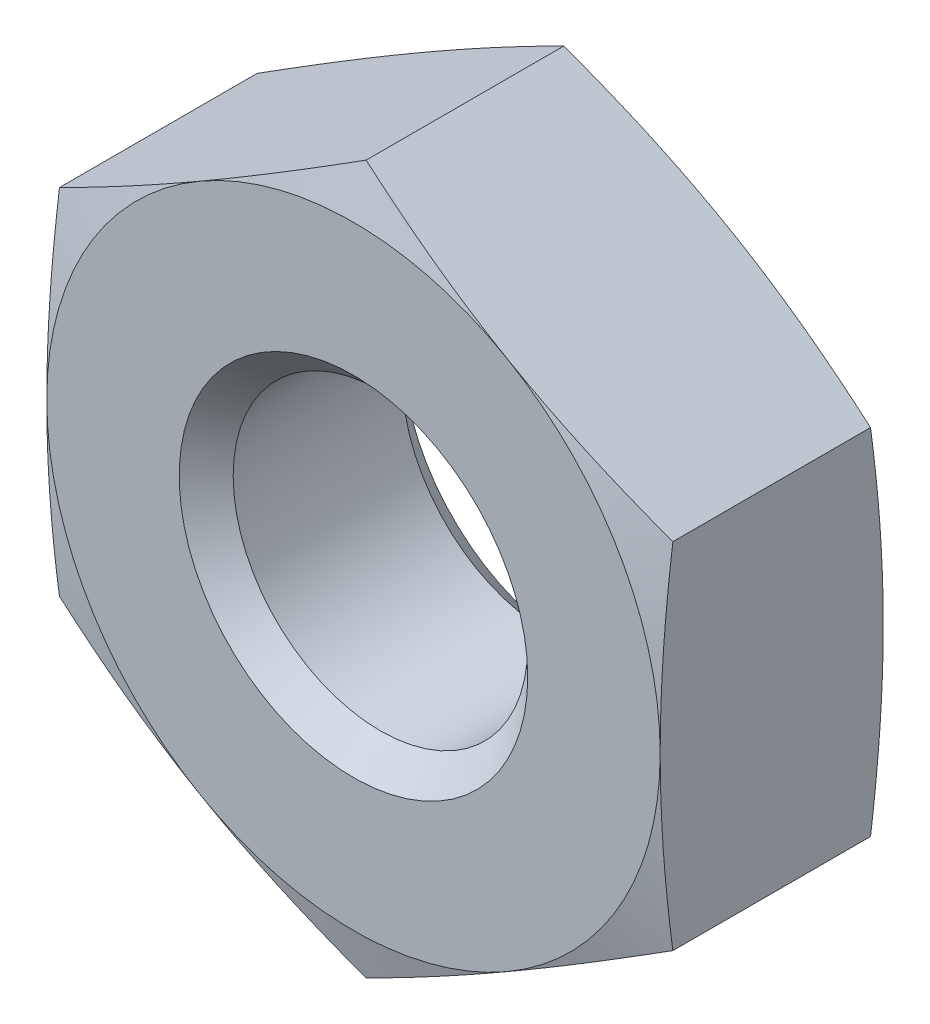
ISO-10303-21;
HEADER;
FILE_DESCRIPTION(('STEP AP214'),'2;1');
FILE_NAME('part.step','',(''),(''),'','','');
FILE_SCHEMA(('AUTOMOTIVE_DESIGN { 1 0 10303 214 1 1 1 1 }'));
ENDSEC;
DATA;
#1=APPLICATION_CONTEXT('core data for automotive mechanical design processes');
#2=APPLICATION_PROTOCOL_DEFINITION('international standard','automotive_design',2000,#1);
#3=PRODUCT_CONTEXT('',#1,'mechanical');
#4=PRODUCT('Part','Part','',(#3));
#5=PRODUCT_RELATED_PRODUCT_CATEGORY('part','',(#4));
#6=PRODUCT_DEFINITION_FORMATION('','',#4);
#7=PRODUCT_DEFINITION_CONTEXT('part definition',#1,'design');
#8=PRODUCT_DEFINITION('design','',#6,#7);
#9=PRODUCT_DEFINITION_SHAPE('','',#8);
#10=(LENGTH_UNIT() NAMED_UNIT(*) SI_UNIT(.MILLI.,.METRE.));
#11=(NAMED_UNIT(*) PLANE_ANGLE_UNIT() SI_UNIT($,.RADIAN.));
#12=(NAMED_UNIT(*) SI_UNIT($,.STERADIAN.) SOLID_ANGLE_UNIT());
#13=UNCERTAINTY_MEASURE_WITH_UNIT(LENGTH_MEASURE(1.E-05),#10,'distance_accuracy_value','');
#14=(GEOMETRIC_REPRESENTATION_CONTEXT(3) GLOBAL_UNCERTAINTY_ASSIGNED_CONTEXT((#13)) GLOBAL_UNIT_ASSIGNED_CONTEXT((#10,
#11,#12)) REPRESENTATION_CONTEXT('',''));
#15=CARTESIAN_POINT('',(0.,0.,0.));
#16=DIRECTION('',(0.,0.,1.));
#17=DIRECTION('',(1.,0.,0.));
#18=AXIS2_PLACEMENT_3D('',#15,#16,#17);
#19=CARTESIAN_POINT('',(0.,0.,0.));
#20=DIRECTION('',(0.,0.,-1.));
#21=DIRECTION('',(-1.,0.,0.));
#22=AXIS2_PLACEMENT_3D('',#19,#20,#21);
#23=PLANE('',#22);
#24=CARTESIAN_POINT('',(0.,0.,0.));
#25=DIRECTION('',(0.,0.,1.));
#26=DIRECTION('',(1.,0.,0.));
#27=AXIS2_PLACEMENT_3D('',#24,#25,#26);
#28=CIRCLE('',#27,5.588);
#29=CARTESIAN_POINT('',(5.588,0.,0.));
#30=VERTEX_POINT('',#29);
#31=CARTESIAN_POINT('',(2.79400000000005,4.83934995634742,0.));
#32=VERTEX_POINT('',#31);
#33=EDGE_CURVE('E11',#30,#32,#28,.T.);
#34=ORIENTED_EDGE('',*,*,#33,.T.);
#35=CARTESIAN_POINT('',(-2.79400000000005,4.83934995634742,0.));
#36=VERTEX_POINT('',#35);
#37=EDGE_CURVE('E43',#32,#36,#28,.T.);
#38=ORIENTED_EDGE('',*,*,#37,.T.);
#39=CARTESIAN_POINT('',(-5.588,0.,0.));
#40=VERTEX_POINT('',#39);
#41=EDGE_CURVE('E328',#36,#40,#28,.T.);
#42=ORIENTED_EDGE('',*,*,#41,.T.);
#43=CARTESIAN_POINT('',(-2.79400000000005,-4.83934995634742,0.));
#44=VERTEX_POINT('',#43);
#45=EDGE_CURVE('E321',#40,#44,#28,.T.);
#46=ORIENTED_EDGE('',*,*,#45,.T.);
#47=CARTESIAN_POINT('',(2.79400000000005,-4.83934995634742,0.));
#48=VERTEX_POINT('',#47);
#49=EDGE_CURVE('E324',#44,#48,#28,.T.);
#50=ORIENTED_EDGE('',*,*,#49,.T.);
#51=EDGE_CURVE('E44',#48,#30,#28,.T.);
#52=ORIENTED_EDGE('',*,*,#51,.T.);
#53=EDGE_LOOP('',(#34,#38,#42,#46,#50,#52));
#54=FACE_BOUND('',#53,.T.);
#55=CARTESIAN_POINT('',(0.,0.,0.));
#56=DIRECTION('',(0.,0.,1.));
#57=DIRECTION('',(1.,0.,0.));
#58=AXIS2_PLACEMENT_3D('',#55,#56,#57);
#59=CIRCLE('',#58,3.175);
#60=CARTESIAN_POINT('',(3.175,0.,0.));
#61=VERTEX_POINT('',#60);
#62=EDGE_CURVE('E185',#61,#61,#59,.T.);
#63=ORIENTED_EDGE('',*,*,#62,.F.);
#64=EDGE_LOOP('',(#63));
#65=FACE_BOUND('',#64,.T.);
#66=ADVANCED_FACE('F36',(#54,#65),#23,.F.);
#67=CARTESIAN_POINT('',(0.,5.588,-4.064));
#68=DIRECTION('',(0.,0.,1.));
#69=DIRECTION('',(1.,0.,0.));
#70=AXIS2_PLACEMENT_3D('',#67,#68,#69);
#71=PLANE('',#70);
#72=CARTESIAN_POINT('',(0.,0.,-4.064));
#73=DIRECTION('',(0.,0.,1.));
#74=DIRECTION('',(1.,0.,0.));
#75=AXIS2_PLACEMENT_3D('',#72,#73,#74);
#76=CIRCLE('',#75,5.588);
#77=CARTESIAN_POINT('',(5.588,0.,-4.064));
#78=VERTEX_POINT('',#77);
#79=CARTESIAN_POINT('',(2.79400000000005,4.83934995634742,-4.064));
#80=VERTEX_POINT('',#79);
#81=EDGE_CURVE('E359',#78,#80,#76,.T.);
#82=ORIENTED_EDGE('',*,*,#81,.F.);
#83=CARTESIAN_POINT('',(2.79400000000005,-4.83934995634742,-4.064));
#84=VERTEX_POINT('',#83);
#85=EDGE_CURVE('E362',#84,#78,#76,.T.);
#86=ORIENTED_EDGE('',*,*,#85,.F.);
#87=CARTESIAN_POINT('',(-2.79400000000005,-4.83934995634742,-4.064));
#88=VERTEX_POINT('',#87);
#89=EDGE_CURVE('E363',#88,#84,#76,.T.);
#90=ORIENTED_EDGE('',*,*,#89,.F.);
#91=CARTESIAN_POINT('',(-5.588,0.,-4.064));
#92=VERTEX_POINT('',#91);
#93=EDGE_CURVE('E143',#92,#88,#76,.T.);
#94=ORIENTED_EDGE('',*,*,#93,.F.);
#95=CARTESIAN_POINT('',(-2.79400000000005,4.83934995634742,-4.064));
#96=VERTEX_POINT('',#95);
#97=EDGE_CURVE('E360',#96,#92,#76,.T.);
#98=ORIENTED_EDGE('',*,*,#97,.F.);
#99=EDGE_CURVE('E356',#80,#96,#76,.T.);
#100=ORIENTED_EDGE('',*,*,#99,.F.);
#101=EDGE_LOOP('',(#82,#86,#90,#94,#98,#100));
#102=FACE_BOUND('',#101,.T.);
#103=CARTESIAN_POINT('',(0.,0.,-4.064));
#104=DIRECTION('',(0.,0.,1.));
#105=DIRECTION('',(1.,0.,0.));
#106=AXIS2_PLACEMENT_3D('',#103,#104,#105);
#107=CIRCLE('',#106,3.175);
#108=CARTESIAN_POINT('',(3.175,0.,-4.064));
#109=VERTEX_POINT('',#108);
#110=EDGE_CURVE('E205',#109,#109,#107,.T.);
#111=ORIENTED_EDGE('',*,*,#110,.T.);
#112=EDGE_LOOP('',(#111));
#113=FACE_BOUND('',#112,.T.);
#114=ADVANCED_FACE('F209',(#102,#113),#71,.F.);
#115=CARTESIAN_POINT('',(0.,0.,-0.29946001746102));
#116=DIRECTION('',(0.,0.,-1.));
#117=DIRECTION('',(-1.,0.,0.));
#118=AXIS2_PLACEMENT_3D('',#115,#116,#117);
#119=CONICAL_SURFACE('',#118,6.7056,1.30899693899575);
#120=CARTESIAN_POINT('',(-5.5882,3.22611783417776,-0.231664070559589));
#121=CARTESIAN_POINT('',(-5.35612782990446,3.36010476405385,-0.195746870929783));
#122=CARTESIAN_POINT('',(-5.12363487986488,3.49433463134389,-0.163139951670658));
#123=CARTESIAN_POINT('',(-4.65782789403413,3.76326842000369,-0.105852616921359));
#124=CARTESIAN_POINT('',(-4.42451356350618,3.8979725115398,-0.0811754211835394));
#125=CARTESIAN_POINT('',(-3.95847843653514,4.16703801754836,-0.0411882021790151));
#126=CARTESIAN_POINT('',(-3.72576079157954,4.30139761250865,-0.0258304913572314));
#127=CARTESIAN_POINT('',(-3.26002872031104,4.57028814922577,-0.0052373695311401));
#128=CARTESIAN_POINT('',(-3.02701436015552,4.70481905278661,0.));
#129=CARTESIAN_POINT('',(-2.56098563984448,4.97388085990829,0.));
#130=CARTESIAN_POINT('',(-2.32797127968896,5.10841176346913,-0.00523736953114312));
#131=CARTESIAN_POINT('',(-1.86223920842046,5.37730230018625,-0.0258304913572373));
#132=CARTESIAN_POINT('',(-1.62952156346486,5.51166189514654,-0.0411882021790223));
#133=CARTESIAN_POINT('',(-1.16348643649382,5.7807274011551,-0.0811754211835491));
#134=CARTESIAN_POINT('',(-0.930172105965868,5.91543149269121,-0.105852616921369));
#135=CARTESIAN_POINT('',(-0.464365120135121,6.18436528135101,-0.163139951670671));
#136=CARTESIAN_POINT('',(-0.231872170095539,6.31859514864105,-0.195746870929797));
#137=CARTESIAN_POINT('',(0.00020000000000052,6.45258207851714,-0.231664070559604));
#138=B_SPLINE_CURVE_WITH_KNOTS('',3,(#120,#121,#122,#123,#124,#125,#126,#127,#128,#129,#130,
#131,#132,#133,#134,#135,#136,#137),.UNSPECIFIED.,.F.,.F.,(4,2,2,2,2,2,2,2,4),(0.,
0.811153043466145,1.62263502922855,2.42992887829337,3.23706648113787,4.04420408398236,
4.85149793304719,5.66297991880959,6.47413296227574),.UNSPECIFIED.);
#139=CARTESIAN_POINT('',(-5.588,3.2262333042316,-0.231633129621396));
#140=VERTEX_POINT('',#139);
#141=EDGE_CURVE('E336',#140,#36,#138,.T.);
#142=ORIENTED_EDGE('',*,*,#141,.F.);
#143=CARTESIAN_POINT('',(-5.588,-8.5345781558909,-1.23610698190292));
#144=CARTESIAN_POINT('',(-5.588,-8.2810666555153,-1.17929190345188));
#145=CARTESIAN_POINT('',(-5.588,-8.02739659166418,-1.12317167601285));
#146=CARTESIAN_POINT('',(-5.588,-7.51966146428766,-1.01269598670537));
#147=CARTESIAN_POINT('',(-5.588,-7.26559638419787,-0.958340601055299));
#148=CARTESIAN_POINT('',(-5.588,-6.75676576190763,-0.851722356973886));
#149=CARTESIAN_POINT('',(-5.588,-6.50199977706657,-0.799461603507953));
#150=CARTESIAN_POINT('',(-5.588,-5.99193753642248,-0.697596721983616));
#151=CARTESIAN_POINT('',(-5.588,-5.73664128511371,-0.647992571503833));
#152=CARTESIAN_POINT('',(-5.588,-5.2274623256548,-0.552455801915283));
#153=CARTESIAN_POINT('',(-5.588,-4.97358453389165,-0.506497108885283));
#154=CARTESIAN_POINT('',(-5.588,-4.46513644926147,-0.41859214361228));
#155=CARTESIAN_POINT('',(-5.588,-4.21056617175893,-0.376645783080679));
#156=CARTESIAN_POINT('',(-5.588,-3.70068369727896,-0.297709945270376));
#157=CARTESIAN_POINT('',(-5.588,-3.44537159559778,-0.260719857769151));
#158=CARTESIAN_POINT('',(-5.588,-2.93393493875483,-0.192786603359327));
#159=CARTESIAN_POINT('',(-5.588,-2.67781038283214,-0.161843442115828));
#160=CARTESIAN_POINT('',(-5.588,-2.16185925688461,-0.106880239566573));
#161=CARTESIAN_POINT('',(-5.588,-1.90202373231597,-0.0829430089921265));
#162=CARTESIAN_POINT('',(-5.588,-1.38169945268913,-0.0436429914353551));
#163=CARTESIAN_POINT('',(-5.588,-1.12121071274943,-0.0282800078110872));
#164=CARTESIAN_POINT('',(-5.588,-0.599957865229125,-0.00702451532729913));
#165=CARTESIAN_POINT('',(-5.588,-0.339193936752168,-0.0011277027289359));
#166=CARTESIAN_POINT('',(-5.588,0.1823714205785,0.00083289998433114));
#167=CARTESIAN_POINT('',(-5.588,0.443172849399691,-0.00310330142432177));
#168=CARTESIAN_POINT('',(-5.588,0.965395783501898,-0.0205873684441134));
#169=CARTESIAN_POINT('',(-5.588,1.22681609697997,-0.0341701185888975));
#170=CARTESIAN_POINT('',(-5.588,1.74904192430596,-0.0701719589647683));
#171=CARTESIAN_POINT('',(-5.588,2.00984742441393,-0.0925912448277076));
#172=CARTESIAN_POINT('',(-5.588,2.53084143141298,-0.145133688666206));
#173=CARTESIAN_POINT('',(-5.588,2.79102942338414,-0.175261874228818));
#174=CARTESIAN_POINT('',(-5.588,3.31056805499895,-0.241968464922291));
#175=CARTESIAN_POINT('',(-5.588,3.56991869201101,-0.278546890304492));
#176=CARTESIAN_POINT('',(-5.588,4.07066345789838,-0.354386980825567));
#177=CARTESIAN_POINT('',(-5.588,4.31210931806812,-0.393310528582692));
#178=CARTESIAN_POINT('',(-5.588,4.79436465416929,-0.474935820185719));
#179=CARTESIAN_POINT('',(-5.588,5.03517411255358,-0.517637667111996));
#180=CARTESIAN_POINT('',(-5.588,5.51624475472888,-0.606128311310801));
#181=CARTESIAN_POINT('',(-5.588,5.75650588738696,-0.65191738521801));
#182=CARTESIAN_POINT('',(-5.588,6.23653469126863,-0.746018904252824));
#183=CARTESIAN_POINT('',(-5.588,6.4763023560569,-0.794331382074125));
#184=CARTESIAN_POINT('',(-5.588,7.19507734129352,-0.942368376905111));
#185=CARTESIAN_POINT('',(-5.588,7.67344976698298,-1.04517234354635));
#186=CARTESIAN_POINT('',(-5.588,8.6289224376089,-1.25634555799704));
#187=CARTESIAN_POINT('',(-5.588,9.10602275524918,-1.36471448026011));
#188=CARTESIAN_POINT('',(-5.588,10.0546296591299,-1.58428870830944));
#189=CARTESIAN_POINT('',(-5.588,10.5261451434712,-1.69545567846192));
#190=CARTESIAN_POINT('',(-5.588,11.468518305583,-1.9205727346029));
#191=CARTESIAN_POINT('',(-5.588,11.9393759712045,-2.03452287129334));
#192=CARTESIAN_POINT('',(-5.588,12.8800071547142,-2.26433759268933));
#193=CARTESIAN_POINT('',(-5.588,13.3497812934371,-2.38019964138322));
#194=CARTESIAN_POINT('',(-5.588,14.2889203682476,-2.61350580925147));
#195=CARTESIAN_POINT('',(-5.588,14.7582853173276,-2.73094987608966));
#196=CARTESIAN_POINT('',(-5.588,15.2275076501709,-2.84895420254379));
#197=B_SPLINE_CURVE_WITH_KNOTS('',3,(#143,#144,#145,#146,#147,#148,#149,#150,#151,#152,#153,
#154,#155,#156,#157,#158,#159,#160,#161,#162,#163,#164,#165,#166,#167,#168,#169,#170,#171,#172,
#173,#174,#175,#176,#177,#178,#179,#180,#181,#182,#183,#184,#185,#186,#187,#188,#189,#190,#191,
#192,#193,#194,#195,#196),.UNSPECIFIED.,.F.,.F.,(4,2,2,2,2,2,2,2,2,2,2,2,2,2,2,2,2,2,2,2,2,2,2,
2,2,2,4),(0.,0.77940313721841,1.55883988993779,2.33904122995756,3.1192359841433,
3.89322268107899,4.66719234305344,5.4410666251817,6.21494163231528,6.99762519889382,
7.78029081465488,8.5626004952282,9.34490950142015,10.1300620493507,10.9152319807312,
11.7009152949557,12.4866010759757,13.2202552360327,13.9539294179764,14.6876694292733,
15.4214189494036,16.8892442231801,18.3569837277075,19.8103005500229,21.2636438677041,
22.7151937170009,24.1666956636387),.UNSPECIFIED.);
#198=EDGE_CURVE('E154',#40,#140,#197,.T.);
#199=ORIENTED_EDGE('',*,*,#198,.F.);
#200=ORIENTED_EDGE('',*,*,#41,.F.);
#201=EDGE_LOOP('',(#142,#199,#200));
#202=FACE_BOUND('',#201,.T.);
#203=ADVANCED_FACE('F227',(#202),#119,.T.);
#204=CARTESIAN_POINT('',(0.,6.4524666084633,-0.23163312962141));
#205=VERTEX_POINT('',#204);
#206=EDGE_CURVE('E333',#36,#205,#138,.T.);
#207=ORIENTED_EDGE('',*,*,#206,.F.);
#208=ORIENTED_EDGE('',*,*,#37,.F.);
#209=CARTESIAN_POINT('',(-0.0002,6.45258207851714,-0.231664070559604));
#210=CARTESIAN_POINT('',(0.231872170095539,6.31859514864105,-0.195746870929797));
#211=CARTESIAN_POINT('',(0.464365120135121,6.18436528135101,-0.163139951670671));
#212=CARTESIAN_POINT('',(0.930172105965868,5.91543149269121,-0.105852616921369));
#213=CARTESIAN_POINT('',(1.16348643649382,5.7807274011551,-0.081175421183549));
#214=CARTESIAN_POINT('',(1.62952156346486,5.51166189514654,-0.0411882021790222));
#215=CARTESIAN_POINT('',(1.86223920842046,5.37730230018625,-0.0258304913572372));
#216=CARTESIAN_POINT('',(2.32797127968896,5.10841176346913,-0.00523736953114299));
#217=CARTESIAN_POINT('',(2.56098563984448,4.97388085990829,0.));
#218=CARTESIAN_POINT('',(3.02701436015552,4.70481905278661,0.));
#219=CARTESIAN_POINT('',(3.26002872031104,4.57028814922577,-0.00523736953114009));
#220=CARTESIAN_POINT('',(3.72576079157954,4.30139761250865,-0.0258304913572314));
#221=CARTESIAN_POINT('',(3.95847843653514,4.16703801754836,-0.041188202179015));
#222=CARTESIAN_POINT('',(4.42451356350618,3.8979725115398,-0.0811754211835393));
#223=CARTESIAN_POINT('',(4.65782789403413,3.76326842000369,-0.105852616921359));
#224=CARTESIAN_POINT('',(5.12363487986488,3.49433463134389,-0.163139951670658));
#225=CARTESIAN_POINT('',(5.35612782990446,3.36010476405385,-0.195746870929783));
#226=CARTESIAN_POINT('',(5.5882,3.22611783417776,-0.231664070559589));
#227=B_SPLINE_CURVE_WITH_KNOTS('',3,(#209,#210,#211,#212,#213,#214,#215,#216,#217,#218,#219,
#220,#221,#222,#223,#224,#225,#226),.UNSPECIFIED.,.F.,.F.,(4,2,2,2,2,2,2,2,4),(0.,
0.811153043466144,1.62263502922855,2.42992887829337,3.23706648113787,4.04420408398236,
4.85149793304719,5.66297991880959,6.47413296227574),.UNSPECIFIED.);
#228=EDGE_CURVE('E266',#205,#32,#227,.T.);
#229=ORIENTED_EDGE('',*,*,#228,.F.);
#230=EDGE_LOOP('',(#207,#208,#229));
#231=FACE_BOUND('',#230,.T.);
#232=ADVANCED_FACE('F275',(#231),#119,.T.);
#233=CARTESIAN_POINT('',(5.588,3.2262333042316,-0.231633129621396));
#234=VERTEX_POINT('',#233);
#235=EDGE_CURVE('E261',#32,#234,#227,.T.);
#236=ORIENTED_EDGE('',*,*,#235,.F.);
#237=ORIENTED_EDGE('',*,*,#33,.F.);
#238=CARTESIAN_POINT('',(5.588,-8.5345781558909,-1.23610698190292));
#239=CARTESIAN_POINT('',(5.588,-8.2810666555153,-1.17929190345188));
#240=CARTESIAN_POINT('',(5.588,-8.02739659166418,-1.12317167601285));
#241=CARTESIAN_POINT('',(5.588,-7.51966146428766,-1.01269598670537));
#242=CARTESIAN_POINT('',(5.588,-7.26559638419787,-0.958340601055299));
#243=CARTESIAN_POINT('',(5.588,-6.75676576190763,-0.851722356973886));
#244=CARTESIAN_POINT('',(5.588,-6.50199977706657,-0.799461603507953));
#245=CARTESIAN_POINT('',(5.588,-5.99193753642248,-0.697596721983616));
#246=CARTESIAN_POINT('',(5.588,-5.73664128511371,-0.647992571503833));
#247=CARTESIAN_POINT('',(5.588,-5.2274623256548,-0.552455801915283));
#248=CARTESIAN_POINT('',(5.588,-4.97358453389165,-0.506497108885283));
#249=CARTESIAN_POINT('',(5.588,-4.46513644926147,-0.41859214361228));
#250=CARTESIAN_POINT('',(5.588,-4.21056617175893,-0.376645783080679));
#251=CARTESIAN_POINT('',(5.588,-3.70068369727896,-0.297709945270376));
#252=CARTESIAN_POINT('',(5.588,-3.44537159559778,-0.260719857769151));
#253=CARTESIAN_POINT('',(5.588,-2.93393493875483,-0.192786603359327));
#254=CARTESIAN_POINT('',(5.588,-2.67781038283214,-0.161843442115828));
#255=CARTESIAN_POINT('',(5.588,-2.16185925688461,-0.106880239566573));
#256=CARTESIAN_POINT('',(5.588,-1.90202373231597,-0.0829430089921265));
#257=CARTESIAN_POINT('',(5.588,-1.38169945268913,-0.0436429914353551));
#258=CARTESIAN_POINT('',(5.588,-1.12121071274943,-0.0282800078110872));
#259=CARTESIAN_POINT('',(5.588,-0.599957865229125,-0.00702451532729913));
#260=CARTESIAN_POINT('',(5.588,-0.339193936752168,-0.0011277027289359));
#261=CARTESIAN_POINT('',(5.588,0.1823714205785,0.00083289998433114));
#262=CARTESIAN_POINT('',(5.588,0.443172849399691,-0.00310330142432177));
#263=CARTESIAN_POINT('',(5.588,0.965395783501898,-0.0205873684441134));
#264=CARTESIAN_POINT('',(5.588,1.22681609697997,-0.0341701185888975));
#265=CARTESIAN_POINT('',(5.588,1.74904192430596,-0.0701719589647683));
#266=CARTESIAN_POINT('',(5.588,2.00984742441393,-0.0925912448277076));
#267=CARTESIAN_POINT('',(5.588,2.53084143141298,-0.145133688666206));
#268=CARTESIAN_POINT('',(5.588,2.79102942338414,-0.175261874228818));
#269=CARTESIAN_POINT('',(5.588,3.31056805499895,-0.241968464922291));
#270=CARTESIAN_POINT('',(5.588,3.56991869201101,-0.278546890304492));
#271=CARTESIAN_POINT('',(5.588,4.07066345789838,-0.354386980825567));
#272=CARTESIAN_POINT('',(5.588,4.31210931806812,-0.393310528582692));
#273=CARTESIAN_POINT('',(5.588,4.79436465416929,-0.474935820185719));
#274=CARTESIAN_POINT('',(5.588,5.03517411255358,-0.517637667111996));
#275=CARTESIAN_POINT('',(5.588,5.51624475472888,-0.606128311310801));
#276=CARTESIAN_POINT('',(5.588,5.75650588738696,-0.65191738521801));
#277=CARTESIAN_POINT('',(5.588,6.23653469126863,-0.746018904252824));
#278=CARTESIAN_POINT('',(5.588,6.4763023560569,-0.794331382074125));
#279=CARTESIAN_POINT('',(5.588,7.19507734129352,-0.942368376905111));
#280=CARTESIAN_POINT('',(5.588,7.67344976698298,-1.04517234354635));
#281=CARTESIAN_POINT('',(5.588,8.6289224376089,-1.25634555799704));
#282=CARTESIAN_POINT('',(5.588,9.10602275524918,-1.36471448026011));
#283=CARTESIAN_POINT('',(5.588,10.0546296591299,-1.58428870830944));
#284=CARTESIAN_POINT('',(5.588,10.5261451434712,-1.69545567846192));
#285=CARTESIAN_POINT('',(5.588,11.468518305583,-1.9205727346029));
#286=CARTESIAN_POINT('',(5.588,11.9393759712045,-2.03452287129334));
#287=CARTESIAN_POINT('',(5.588,12.8800071547142,-2.26433759268933));
#288=CARTESIAN_POINT('',(5.588,13.3497812934371,-2.38019964138322));
#289=CARTESIAN_POINT('',(5.588,14.2889203682476,-2.61350580925147));
#290=CARTESIAN_POINT('',(5.588,14.7582853173276,-2.73094987608966));
#291=CARTESIAN_POINT('',(5.588,15.2275076501709,-2.84895420254379));
#292=B_SPLINE_CURVE_WITH_KNOTS('',3,(#238,#239,#240,#241,#242,#243,#244,#245,#246,#247,#248,
#249,#250,#251,#252,#253,#254,#255,#256,#257,#258,#259,#260,#261,#262,#263,#264,#265,#266,#267,
#268,#269,#270,#271,#272,#273,#274,#275,#276,#277,#278,#279,#280,#281,#282,#283,#284,#285,#286,
#287,#288,#289,#290,#291),.UNSPECIFIED.,.F.,.F.,(4,2,2,2,2,2,2,2,2,2,2,2,2,2,2,2,2,2,2,2,2,2,2,
2,2,2,4),(0.,0.77940313721841,1.55883988993779,2.33904122995756,3.1192359841433,
3.89322268107899,4.66719234305344,5.4410666251817,6.21494163231528,6.99762519889382,
7.78029081465488,8.5626004952282,9.34490950142015,10.1300620493507,10.9152319807312,
11.7009152949557,12.4866010759757,13.2202552360327,13.9539294179764,14.6876694292733,
15.4214189494036,16.8892442231801,18.3569837277075,19.8103005500229,21.2636438677041,
22.7151937170009,24.1666956636387),.UNSPECIFIED.);
#293=EDGE_CURVE('E293',#234,#30,#292,.F.);
#294=ORIENTED_EDGE('',*,*,#293,.F.);
#295=EDGE_LOOP('',(#236,#237,#294));
#296=FACE_BOUND('',#295,.T.);
#297=ADVANCED_FACE('F347',(#296),#119,.T.);
#298=CARTESIAN_POINT('',(5.588,-3.2262333042316,-0.231633129621396));
#299=VERTEX_POINT('',#298);
#300=EDGE_CURVE('E289',#30,#299,#292,.F.);
#301=ORIENTED_EDGE('',*,*,#300,.F.);
#302=ORIENTED_EDGE('',*,*,#51,.F.);
#303=CARTESIAN_POINT('',(5.5882,-3.22611783417776,-0.231664070559589));
#304=CARTESIAN_POINT('',(5.35612782990446,-3.36010476405385,-0.195746870929783));
#305=CARTESIAN_POINT('',(5.12363487986488,-3.49433463134389,-0.163139951670658));
#306=CARTESIAN_POINT('',(4.65782789403413,-3.76326842000369,-0.105852616921359));
#307=CARTESIAN_POINT('',(4.42451356350618,-3.8979725115398,-0.0811754211835394));
#308=CARTESIAN_POINT('',(3.95847843653514,-4.16703801754836,-0.0411882021790151));
#309=CARTESIAN_POINT('',(3.72576079157954,-4.30139761250865,-0.0258304913572314));
#310=CARTESIAN_POINT('',(3.26002872031104,-4.57028814922577,-0.0052373695311401));
#311=CARTESIAN_POINT('',(3.02701436015552,-4.70481905278661,0.));
#312=CARTESIAN_POINT('',(2.56098563984448,-4.97388085990829,0.));
#313=CARTESIAN_POINT('',(2.32797127968896,-5.10841176346913,-0.00523736953114312));
#314=CARTESIAN_POINT('',(1.86223920842046,-5.37730230018625,-0.0258304913572373));
#315=CARTESIAN_POINT('',(1.62952156346486,-5.51166189514654,-0.0411882021790223));
#316=CARTESIAN_POINT('',(1.16348643649382,-5.7807274011551,-0.0811754211835491));
#317=CARTESIAN_POINT('',(0.930172105965868,-5.91543149269121,-0.105852616921369));
#318=CARTESIAN_POINT('',(0.464365120135121,-6.18436528135101,-0.163139951670671));
#319=CARTESIAN_POINT('',(0.231872170095539,-6.31859514864105,-0.195746870929797));
#320=CARTESIAN_POINT('',(-0.00020000000000052,-6.45258207851714,-0.231664070559604));
#321=B_SPLINE_CURVE_WITH_KNOTS('',3,(#303,#304,#305,#306,#307,#308,#309,#310,#311,#312,#313,
#314,#315,#316,#317,#318,#319,#320),.UNSPECIFIED.,.F.,.F.,(4,2,2,2,2,2,2,2,4),(0.,
0.811153043466145,1.62263502922855,2.42992887829337,3.23706648113787,4.04420408398236,
4.85149793304719,5.66297991880959,6.47413296227574),.UNSPECIFIED.);
#322=EDGE_CURVE('E299',#299,#48,#321,.T.);
#323=ORIENTED_EDGE('',*,*,#322,.F.);
#324=EDGE_LOOP('',(#301,#302,#323));
#325=FACE_BOUND('',#324,.T.);
#326=ADVANCED_FACE('F387',(#325),#119,.T.);
#327=CARTESIAN_POINT('',(0.,-6.4524666084633,-0.23163312962141));
#328=VERTEX_POINT('',#327);
#329=EDGE_CURVE('E284',#48,#328,#321,.T.);
#330=ORIENTED_EDGE('',*,*,#329,.F.);
#331=ORIENTED_EDGE('',*,*,#49,.F.);
#332=CARTESIAN_POINT('',(0.0002,-6.45258207851714,-0.231664070559604));
#333=CARTESIAN_POINT('',(-0.231872170095539,-6.31859514864105,-0.195746870929797));
#334=CARTESIAN_POINT('',(-0.464365120135121,-6.18436528135101,-0.163139951670671));
#335=CARTESIAN_POINT('',(-0.930172105965868,-5.91543149269121,-0.105852616921369));
#336=CARTESIAN_POINT('',(-1.16348643649382,-5.7807274011551,-0.081175421183549));
#337=CARTESIAN_POINT('',(-1.62952156346486,-5.51166189514654,-0.0411882021790222));
#338=CARTESIAN_POINT('',(-1.86223920842046,-5.37730230018625,-0.0258304913572372));
#339=CARTESIAN_POINT('',(-2.32797127968896,-5.10841176346913,-0.00523736953114299));
#340=CARTESIAN_POINT('',(-2.56098563984448,-4.97388085990829,0.));
#341=CARTESIAN_POINT('',(-3.02701436015552,-4.70481905278661,0.));
#342=CARTESIAN_POINT('',(-3.26002872031104,-4.57028814922577,-0.00523736953114009));
#343=CARTESIAN_POINT('',(-3.72576079157954,-4.30139761250865,-0.0258304913572314));
#344=CARTESIAN_POINT('',(-3.95847843653514,-4.16703801754836,-0.041188202179015));
#345=CARTESIAN_POINT('',(-4.42451356350618,-3.8979725115398,-0.0811754211835393));
#346=CARTESIAN_POINT('',(-4.65782789403413,-3.76326842000369,-0.105852616921359));
#347=CARTESIAN_POINT('',(-5.12363487986488,-3.49433463134389,-0.163139951670658));
#348=CARTESIAN_POINT('',(-5.35612782990446,-3.36010476405385,-0.195746870929783));
#349=CARTESIAN_POINT('',(-5.5882,-3.22611783417776,-0.231664070559589));
#350=B_SPLINE_CURVE_WITH_KNOTS('',3,(#332,#333,#334,#335,#336,#337,#338,#339,#340,#341,#342,
#343,#344,#345,#346,#347,#348,#349),.UNSPECIFIED.,.F.,.F.,(4,2,2,2,2,2,2,2,4),(0.,
0.811153043466144,1.62263502922855,2.42992887829337,3.23706648113787,4.04420408398236,
4.85149793304719,5.66297991880959,6.47413296227574),.UNSPECIFIED.);
#351=EDGE_CURVE('E146',#328,#44,#350,.T.);
#352=ORIENTED_EDGE('',*,*,#351,.F.);
#353=EDGE_LOOP('',(#330,#331,#352));
#354=FACE_BOUND('',#353,.T.);
#355=ADVANCED_FACE('F325',(#354),#119,.T.);
#356=CARTESIAN_POINT('',(-5.588,-3.2262333042316,-0.231633129621396));
#357=VERTEX_POINT('',#356);
#358=EDGE_CURVE('E138',#44,#357,#350,.T.);
#359=ORIENTED_EDGE('',*,*,#358,.F.);
#360=ORIENTED_EDGE('',*,*,#45,.F.);
#361=EDGE_CURVE('E51',#357,#40,#197,.T.);
#362=ORIENTED_EDGE('',*,*,#361,.F.);
#363=EDGE_LOOP('',(#359,#360,#362));
#364=FACE_BOUND('',#363,.T.);
#365=ADVANCED_FACE('F277',(#364),#119,.T.);
#366=CARTESIAN_POINT('',(0.,6.4524666084633,-4.064));
#367=DIRECTION('',(-0.500000000000008,0.866025403784434,0.));
#368=DIRECTION('',(-0.866025403784434,-0.500000000000008,0.));
#369=AXIS2_PLACEMENT_3D('',#366,#367,#368);
#370=PLANE('',#369);
#371=ORIENTED_EDGE('',*,*,#141,.T.);
#372=ORIENTED_EDGE('',*,*,#206,.T.);
#373=DIRECTION('',(0.,0.,1.));
#374=VECTOR('',#373,1.);
#375=CARTESIAN_POINT('',(0.,6.4524666084633,-4.064));
#376=LINE('',#375,#374);
#377=CARTESIAN_POINT('',(0.,6.4524666084633,-3.83236687037861));
#378=VERTEX_POINT('',#377);
#379=EDGE_CURVE('E131',#378,#205,#376,.T.);
#380=ORIENTED_EDGE('',*,*,#379,.F.);
#381=CARTESIAN_POINT('',(0.00020000000000005,6.45258207851714,-3.83233592944041));
#382=CARTESIAN_POINT('',(-0.23187217009554,6.31859514864105,-3.86825312907022));
#383=CARTESIAN_POINT('',(-0.464365120135121,6.18436528135101,-3.90086004832934));
#384=CARTESIAN_POINT('',(-0.930172105965868,5.91543149269121,-3.95814738307864));
#385=CARTESIAN_POINT('',(-1.16348643649382,5.7807274011551,-3.98282457881646));
#386=CARTESIAN_POINT('',(-1.62952156346486,5.51166189514654,-4.02281179782098));
#387=CARTESIAN_POINT('',(-1.86223920842046,5.37730230018625,-4.03816950864277));
#388=CARTESIAN_POINT('',(-2.32797127968896,5.10841176346913,-4.05876263046886));
#389=CARTESIAN_POINT('',(-2.56098563984448,4.97388085990829,-4.064));
#390=CARTESIAN_POINT('',(-3.02701436015552,4.70481905278661,-4.064));
#391=CARTESIAN_POINT('',(-3.26002872031104,4.57028814922577,-4.05876263046886));
#392=CARTESIAN_POINT('',(-3.72576079157954,4.30139761250865,-4.03816950864277));
#393=CARTESIAN_POINT('',(-3.95847843653514,4.16703801754836,-4.02281179782099));
#394=CARTESIAN_POINT('',(-4.42451356350618,3.8979725115398,-3.98282457881647));
#395=CARTESIAN_POINT('',(-4.65782789403413,3.76326842000369,-3.95814738307865));
#396=CARTESIAN_POINT('',(-5.12363487986488,3.49433463134389,-3.90086004832935));
#397=CARTESIAN_POINT('',(-5.35612782990446,3.36010476405385,-3.86825312907023));
#398=CARTESIAN_POINT('',(-5.5882,3.22611783417776,-3.83233592944043));
#399=B_SPLINE_CURVE_WITH_KNOTS('',3,(#381,#382,#383,#384,#385,#386,#387,#388,#389,#390,#391,
#392,#393,#394,#395,#396,#397,#398),.UNSPECIFIED.,.F.,.F.,(4,2,2,2,2,2,2,2,4),(0.,
0.811153043466144,1.62263502922855,2.42992887829337,3.23706648113787,4.04420408398236,
4.85149793304719,5.66297991880959,6.47413296227573),.UNSPECIFIED.);
#400=EDGE_CURVE('E337',#378,#96,#399,.T.);
#401=ORIENTED_EDGE('',*,*,#400,.T.);
#402=CARTESIAN_POINT('',(-5.588,3.2262333042316,-3.83236687037862));
#403=VERTEX_POINT('',#402);
#404=EDGE_CURVE('E268',#96,#403,#399,.T.);
#405=ORIENTED_EDGE('',*,*,#404,.T.);
#406=DIRECTION('',(0.,0.,1.));
#407=VECTOR('',#406,1.);
#408=CARTESIAN_POINT('',(-5.588,3.2262333042316,-4.064));
#409=LINE('',#408,#407);
#410=EDGE_CURVE('E140',#403,#140,#409,.T.);
#411=ORIENTED_EDGE('',*,*,#410,.T.);
#412=EDGE_LOOP('',(#371,#372,#380,#401,#405,#411));
#413=FACE_BOUND('',#412,.T.);
#414=ADVANCED_FACE('F177',(#413),#370,.T.);
#415=CARTESIAN_POINT('',(5.588,3.2262333042316,-4.064));
#416=DIRECTION('',(0.500000000000008,0.866025403784434,0.));
#417=DIRECTION('',(-0.866025403784434,0.500000000000008,0.));
#418=AXIS2_PLACEMENT_3D('',#415,#416,#417);
#419=PLANE('',#418);
#420=ORIENTED_EDGE('',*,*,#228,.T.);
#421=ORIENTED_EDGE('',*,*,#235,.T.);
#422=DIRECTION('',(0.,0.,1.));
#423=VECTOR('',#422,1.);
#424=CARTESIAN_POINT('',(5.588,3.2262333042316,-4.064));
#425=LINE('',#424,#423);
#426=CARTESIAN_POINT('',(5.588,3.2262333042316,-3.83236687037862));
#427=VERTEX_POINT('',#426);
#428=EDGE_CURVE('E192',#427,#234,#425,.T.);
#429=ORIENTED_EDGE('',*,*,#428,.F.);
#430=CARTESIAN_POINT('',(5.5882,3.22611783417776,-3.83233592944043));
#431=CARTESIAN_POINT('',(5.35612782990446,3.36010476405385,-3.86825312907023));
#432=CARTESIAN_POINT('',(5.12363487986488,3.49433463134389,-3.90086004832935));
#433=CARTESIAN_POINT('',(4.65782789403413,3.76326842000369,-3.95814738307865));
#434=CARTESIAN_POINT('',(4.42451356350618,3.8979725115398,-3.98282457881647));
#435=CARTESIAN_POINT('',(3.95847843653514,4.16703801754836,-4.02281179782099));
#436=CARTESIAN_POINT('',(3.72576079157954,4.30139761250865,-4.03816950864277));
#437=CARTESIAN_POINT('',(3.26002872031104,4.57028814922577,-4.05876263046886));
#438=CARTESIAN_POINT('',(3.02701436015552,4.70481905278661,-4.064));
#439=CARTESIAN_POINT('',(2.56098563984448,4.97388085990829,-4.064));
#440=CARTESIAN_POINT('',(2.32797127968896,5.10841176346913,-4.05876263046886));
#441=CARTESIAN_POINT('',(1.86223920842046,5.37730230018625,-4.03816950864277));
#442=CARTESIAN_POINT('',(1.62952156346486,5.51166189514654,-4.02281179782098));
#443=CARTESIAN_POINT('',(1.16348643649382,5.7807274011551,-3.98282457881646));
#444=CARTESIAN_POINT('',(0.930172105965869,5.91543149269121,-3.95814738307864));
#445=CARTESIAN_POINT('',(0.464365120135122,6.18436528135101,-3.90086004832934));
#446=CARTESIAN_POINT('',(0.23187217009554,6.31859514864105,-3.86825312907022));
#447=CARTESIAN_POINT('',(-0.000199999999999917,6.45258207851714,-3.83233592944041));
#448=B_SPLINE_CURVE_WITH_KNOTS('',3,(#430,#431,#432,#433,#434,#435,#436,#437,#438,#439,#440,
#441,#442,#443,#444,#445,#446,#447),.UNSPECIFIED.,.F.,.F.,(4,2,2,2,2,2,2,2,4),(0.,
0.811153043466144,1.62263502922855,2.42992887829337,3.23706648113787,4.04420408398236,
4.85149793304719,5.66297991880959,6.47413296227573),.UNSPECIFIED.);
#449=EDGE_CURVE('E267',#427,#80,#448,.T.);
#450=ORIENTED_EDGE('',*,*,#449,.T.);
#451=EDGE_CURVE('E255',#80,#378,#448,.T.);
#452=ORIENTED_EDGE('',*,*,#451,.T.);
#453=ORIENTED_EDGE('',*,*,#379,.T.);
#454=EDGE_LOOP('',(#420,#421,#429,#450,#452,#453));
#455=FACE_BOUND('',#454,.T.);
#456=ADVANCED_FACE('F247',(#455),#419,.T.);
#457=CARTESIAN_POINT('',(5.588,-3.2262333042316,-4.064));
#458=DIRECTION('',(1.,0.,0.));
#459=DIRECTION('',(0.,0.,-1.));
#460=AXIS2_PLACEMENT_3D('',#457,#458,#459);
#461=PLANE('',#460);
#462=ORIENTED_EDGE('',*,*,#293,.T.);
#463=ORIENTED_EDGE('',*,*,#300,.T.);
#464=DIRECTION('',(0.,0.,1.));
#465=VECTOR('',#464,1.);
#466=CARTESIAN_POINT('',(5.588,-3.2262333042316,-4.064));
#467=LINE('',#466,#465);
#468=CARTESIAN_POINT('',(5.588,-3.2262333042316,-3.83236687037862));
#469=VERTEX_POINT('',#468);
#470=EDGE_CURVE('E189',#469,#299,#467,.T.);
#471=ORIENTED_EDGE('',*,*,#470,.F.);
#472=CARTESIAN_POINT('',(5.588,-8.53457815589089,-2.82789301809716));
#473=CARTESIAN_POINT('',(5.588,-8.2810666555153,-2.8847080965482));
#474=CARTESIAN_POINT('',(5.588,-8.02739659166418,-2.94082832398722));
#475=CARTESIAN_POINT('',(5.588,-7.51966146428765,-3.0513040132947));
#476=CARTESIAN_POINT('',(5.588,-7.26559638419787,-3.10565939894477));
#477=CARTESIAN_POINT('',(5.588,-6.75676576190763,-3.21227764302617));
#478=CARTESIAN_POINT('',(5.588,-6.50199977706657,-3.2645383964921));
#479=CARTESIAN_POINT('',(5.588,-5.99193753642248,-3.36640327801643));
#480=CARTESIAN_POINT('',(5.588,-5.73664128511371,-3.41600742849621));
#481=CARTESIAN_POINT('',(5.588,-5.2274623256548,-3.51154419808475));
#482=CARTESIAN_POINT('',(5.588,-4.97358453389165,-3.55750289111475));
#483=CARTESIAN_POINT('',(5.588,-4.46513644926147,-3.64540785638775));
#484=CARTESIAN_POINT('',(5.588,-4.21056617175893,-3.68735421691935));
#485=CARTESIAN_POINT('',(5.588,-3.70068369727896,-3.76629005472964));
#486=CARTESIAN_POINT('',(5.588,-3.44537159559778,-3.80328014223087));
#487=CARTESIAN_POINT('',(5.588,-2.93393493875483,-3.87121339664069));
#488=CARTESIAN_POINT('',(5.588,-2.67781038283214,-3.90215655788418));
#489=CARTESIAN_POINT('',(5.588,-2.16185925688461,-3.95711976043343));
#490=CARTESIAN_POINT('',(5.588,-1.90202373231597,-3.98105699100788));
#491=CARTESIAN_POINT('',(5.588,-1.38169945268914,-4.02035700856465));
#492=CARTESIAN_POINT('',(5.588,-1.12121071274944,-4.03571999218892));
#493=CARTESIAN_POINT('',(5.588,-0.599957865229132,-4.0569754846727));
#494=CARTESIAN_POINT('',(5.588,-0.339193936752176,-4.06287229727106));
#495=CARTESIAN_POINT('',(5.588,0.182371420578491,-4.06483289998433));
#496=CARTESIAN_POINT('',(5.588,0.443172849399681,-4.06089669857568));
#497=CARTESIAN_POINT('',(5.588,0.965395783501886,-4.04341263155589));
#498=CARTESIAN_POINT('',(5.588,1.22681609697996,-4.02982988141111));
#499=CARTESIAN_POINT('',(5.588,1.74904192430595,-3.99382804103524));
#500=CARTESIAN_POINT('',(5.588,2.00984742441392,-3.9714087551723));
#501=CARTESIAN_POINT('',(5.588,2.53084143141296,-3.9188663113338));
#502=CARTESIAN_POINT('',(5.588,2.79102942338412,-3.8887381257712));
#503=CARTESIAN_POINT('',(5.588,3.31056805499893,-3.82203153507773));
#504=CARTESIAN_POINT('',(5.588,3.56991869201099,-3.78545310969553));
#505=CARTESIAN_POINT('',(5.588,4.07066345789836,-3.70961301917446));
#506=CARTESIAN_POINT('',(5.588,4.3121093180681,-3.67068947141734));
#507=CARTESIAN_POINT('',(5.588,4.79436465416927,-3.58906417981432));
#508=CARTESIAN_POINT('',(5.588,5.03517411255355,-3.54636233288804));
#509=CARTESIAN_POINT('',(5.588,5.51624475472886,-3.45787168868924));
#510=CARTESIAN_POINT('',(5.588,5.75650588738694,-3.41208261478204));
#511=CARTESIAN_POINT('',(5.588,6.23653469126861,-3.31798109574723));
#512=CARTESIAN_POINT('',(5.588,6.47630235605689,-3.26966861792593));
#513=CARTESIAN_POINT('',(5.588,7.1950773412935,-3.12163162309496));
#514=CARTESIAN_POINT('',(5.588,7.67344976698297,-3.01882765645372));
#515=CARTESIAN_POINT('',(5.588,8.62892243760889,-2.80765444200305));
#516=CARTESIAN_POINT('',(5.588,9.10602275524917,-2.69928551973999));
#517=CARTESIAN_POINT('',(5.588,10.0546296591299,-2.47971129169067));
#518=CARTESIAN_POINT('',(5.588,10.5261451434712,-2.3685443215382));
#519=CARTESIAN_POINT('',(5.588,11.468518305583,-2.14342726539723));
#520=CARTESIAN_POINT('',(5.588,11.9393759712045,-2.0294771287068));
#521=CARTESIAN_POINT('',(5.588,12.8800071547142,-1.79966240731082));
#522=CARTESIAN_POINT('',(5.588,13.3497812934372,-1.68380035861694));
#523=CARTESIAN_POINT('',(5.588,14.2889203682476,-1.45049419074871));
#524=CARTESIAN_POINT('',(5.588,14.7582853173276,-1.33305012391053));
#525=CARTESIAN_POINT('',(5.588,15.2275076501709,-1.2150457974564));
#526=B_SPLINE_CURVE_WITH_KNOTS('',3,(#472,#473,#474,#475,#476,#477,#478,#479,#480,#481,#482,
#483,#484,#485,#486,#487,#488,#489,#490,#491,#492,#493,#494,#495,#496,#497,#498,#499,#500,#501,
#502,#503,#504,#505,#506,#507,#508,#509,#510,#511,#512,#513,#514,#515,#516,#517,#518,#519,#520,
#521,#522,#523,#524,#525),.UNSPECIFIED.,.F.,.F.,(4,2,2,2,2,2,2,2,2,2,2,2,2,2,2,2,2,2,2,2,2,2,2,
2,2,2,4),(0.,0.779403137218408,1.55883988993779,2.33904122995755,3.11923598414329,
3.89322268107897,4.66719234305342,5.44106662518169,6.21494163231526,6.9976251988938,
7.78029081465486,8.56260049522817,9.34490950142013,10.1300620493507,10.9152319807311,
11.7009152949556,12.4866010759757,13.2202552360326,13.9539294179764,14.6876694292732,
15.4214189494035,16.8892442231801,18.3569837277074,19.8103005500228,21.263643867704,
22.7151937170008,24.1666956636387),.UNSPECIFIED.);
#527=EDGE_CURVE('E294',#469,#78,#526,.T.);
#528=ORIENTED_EDGE('',*,*,#527,.T.);
#529=EDGE_CURVE('E295',#78,#427,#526,.T.);
#530=ORIENTED_EDGE('',*,*,#529,.T.);
#531=ORIENTED_EDGE('',*,*,#428,.T.);
#532=EDGE_LOOP('',(#462,#463,#471,#528,#530,#531));
#533=FACE_BOUND('',#532,.T.);
#534=ADVANCED_FACE('F250',(#533),#461,.T.);
#535=CARTESIAN_POINT('',(0.,-6.4524666084633,-4.064));
#536=DIRECTION('',(0.500000000000008,-0.866025403784434,0.));
#537=DIRECTION('',(0.866025403784434,0.500000000000008,0.));
#538=AXIS2_PLACEMENT_3D('',#535,#536,#537);
#539=PLANE('',#538);
#540=ORIENTED_EDGE('',*,*,#322,.T.);
#541=ORIENTED_EDGE('',*,*,#329,.T.);
#542=DIRECTION('',(0.,0.,1.));
#543=VECTOR('',#542,1.);
#544=CARTESIAN_POINT('',(0.,-6.4524666084633,-4.064));
#545=LINE('',#544,#543);
#546=CARTESIAN_POINT('',(0.,-6.4524666084633,-3.83236687037861));
#547=VERTEX_POINT('',#546);
#548=EDGE_CURVE('E139',#547,#328,#545,.T.);
#549=ORIENTED_EDGE('',*,*,#548,.F.);
#550=CARTESIAN_POINT('',(-0.00020000000000005,-6.45258207851714,-3.83233592944041));
#551=CARTESIAN_POINT('',(0.23187217009554,-6.31859514864105,-3.86825312907022));
#552=CARTESIAN_POINT('',(0.464365120135121,-6.18436528135101,-3.90086004832934));
#553=CARTESIAN_POINT('',(0.930172105965868,-5.91543149269121,-3.95814738307864));
#554=CARTESIAN_POINT('',(1.16348643649382,-5.7807274011551,-3.98282457881646));
#555=CARTESIAN_POINT('',(1.62952156346486,-5.51166189514654,-4.02281179782098));
#556=CARTESIAN_POINT('',(1.86223920842046,-5.37730230018625,-4.03816950864277));
#557=CARTESIAN_POINT('',(2.32797127968896,-5.10841176346913,-4.05876263046886));
#558=CARTESIAN_POINT('',(2.56098563984448,-4.97388085990829,-4.064));
#559=CARTESIAN_POINT('',(3.02701436015552,-4.70481905278661,-4.064));
#560=CARTESIAN_POINT('',(3.26002872031104,-4.57028814922577,-4.05876263046886));
#561=CARTESIAN_POINT('',(3.72576079157954,-4.30139761250865,-4.03816950864277));
#562=CARTESIAN_POINT('',(3.95847843653514,-4.16703801754836,-4.02281179782099));
#563=CARTESIAN_POINT('',(4.42451356350618,-3.8979725115398,-3.98282457881647));
#564=CARTESIAN_POINT('',(4.65782789403413,-3.76326842000369,-3.95814738307865));
#565=CARTESIAN_POINT('',(5.12363487986488,-3.49433463134389,-3.90086004832935));
#566=CARTESIAN_POINT('',(5.35612782990446,-3.36010476405385,-3.86825312907023));
#567=CARTESIAN_POINT('',(5.5882,-3.22611783417776,-3.83233592944043));
#568=B_SPLINE_CURVE_WITH_KNOTS('',3,(#550,#551,#552,#553,#554,#555,#556,#557,#558,#559,#560,
#561,#562,#563,#564,#565,#566,#567),.UNSPECIFIED.,.F.,.F.,(4,2,2,2,2,2,2,2,4),(0.,
0.811153043466144,1.62263502922855,2.42992887829337,3.23706648113787,4.04420408398236,
4.85149793304719,5.66297991880959,6.47413296227573),.UNSPECIFIED.);
#569=EDGE_CURVE('E306',#547,#84,#568,.T.);
#570=ORIENTED_EDGE('',*,*,#569,.T.);
#571=EDGE_CURVE('E308',#84,#469,#568,.T.);
#572=ORIENTED_EDGE('',*,*,#571,.T.);
#573=ORIENTED_EDGE('',*,*,#470,.T.);
#574=EDGE_LOOP('',(#540,#541,#549,#570,#572,#573));
#575=FACE_BOUND('',#574,.T.);
#576=ADVANCED_FACE('F169',(#575),#539,.T.);
#577=CARTESIAN_POINT('',(-5.588,-3.2262333042316,-4.064));
#578=DIRECTION('',(-0.500000000000008,-0.866025403784434,0.));
#579=DIRECTION('',(0.866025403784434,-0.500000000000008,0.));
#580=AXIS2_PLACEMENT_3D('',#577,#578,#579);
#581=PLANE('',#580);
#582=ORIENTED_EDGE('',*,*,#351,.T.);
#583=ORIENTED_EDGE('',*,*,#358,.T.);
#584=DIRECTION('',(0.,0.,1.));
#585=VECTOR('',#584,1.);
#586=CARTESIAN_POINT('',(-5.588,-3.2262333042316,-4.064));
#587=LINE('',#586,#585);
#588=CARTESIAN_POINT('',(-5.588,-3.2262333042316,-3.83236687037862));
#589=VERTEX_POINT('',#588);
#590=EDGE_CURVE('E126',#589,#357,#587,.T.);
#591=ORIENTED_EDGE('',*,*,#590,.F.);
#592=CARTESIAN_POINT('',(-5.5882,-3.22611783417776,-3.83233592944043));
#593=CARTESIAN_POINT('',(-5.35612782990446,-3.36010476405385,-3.86825312907023));
#594=CARTESIAN_POINT('',(-5.12363487986488,-3.49433463134389,-3.90086004832935));
#595=CARTESIAN_POINT('',(-4.65782789403413,-3.76326842000369,-3.95814738307865));
#596=CARTESIAN_POINT('',(-4.42451356350618,-3.8979725115398,-3.98282457881647));
#597=CARTESIAN_POINT('',(-3.95847843653514,-4.16703801754836,-4.02281179782099));
#598=CARTESIAN_POINT('',(-3.72576079157954,-4.30139761250865,-4.03816950864277));
#599=CARTESIAN_POINT('',(-3.26002872031104,-4.57028814922577,-4.05876263046886));
#600=CARTESIAN_POINT('',(-3.02701436015552,-4.70481905278661,-4.064));
#601=CARTESIAN_POINT('',(-2.56098563984448,-4.97388085990829,-4.064));
#602=CARTESIAN_POINT('',(-2.32797127968896,-5.10841176346913,-4.05876263046886));
#603=CARTESIAN_POINT('',(-1.86223920842046,-5.37730230018625,-4.03816950864277));
#604=CARTESIAN_POINT('',(-1.62952156346486,-5.51166189514654,-4.02281179782098));
#605=CARTESIAN_POINT('',(-1.16348643649382,-5.7807274011551,-3.98282457881646));
#606=CARTESIAN_POINT('',(-0.930172105965869,-5.91543149269121,-3.95814738307864));
#607=CARTESIAN_POINT('',(-0.464365120135122,-6.18436528135101,-3.90086004832934));
#608=CARTESIAN_POINT('',(-0.23187217009554,-6.31859514864105,-3.86825312907022));
#609=CARTESIAN_POINT('',(0.000199999999999917,-6.45258207851714,-3.83233592944041));
#610=B_SPLINE_CURVE_WITH_KNOTS('',3,(#592,#593,#594,#595,#596,#597,#598,#599,#600,#601,#602,
#603,#604,#605,#606,#607,#608,#609),.UNSPECIFIED.,.F.,.F.,(4,2,2,2,2,2,2,2,4),(0.,
0.811153043466144,1.62263502922855,2.42992887829337,3.23706648113787,4.04420408398236,
4.85149793304719,5.66297991880959,6.47413296227573),.UNSPECIFIED.);
#611=EDGE_CURVE('E135',#589,#88,#610,.T.);
#612=ORIENTED_EDGE('',*,*,#611,.T.);
#613=EDGE_CURVE('E144',#88,#547,#610,.T.);
#614=ORIENTED_EDGE('',*,*,#613,.T.);
#615=ORIENTED_EDGE('',*,*,#548,.T.);
#616=EDGE_LOOP('',(#582,#583,#591,#612,#614,#615));
#617=FACE_BOUND('',#616,.T.);
#618=ADVANCED_FACE('F134',(#617),#581,.T.);
#619=CARTESIAN_POINT('',(-5.588,3.2262333042316,-4.064));
#620=DIRECTION('',(-1.,0.,0.));
#621=DIRECTION('',(0.,0.,1.));
#622=AXIS2_PLACEMENT_3D('',#619,#620,#621);
#623=PLANE('',#622);
#624=ORIENTED_EDGE('',*,*,#361,.T.);
#625=ORIENTED_EDGE('',*,*,#198,.T.);
#626=ORIENTED_EDGE('',*,*,#410,.F.);
#627=CARTESIAN_POINT('',(-5.588,-8.53457815589089,-2.82789301809716));
#628=CARTESIAN_POINT('',(-5.588,-8.2810666555153,-2.8847080965482));
#629=CARTESIAN_POINT('',(-5.588,-8.02739659166418,-2.94082832398722));
#630=CARTESIAN_POINT('',(-5.588,-7.51966146428765,-3.0513040132947));
#631=CARTESIAN_POINT('',(-5.588,-7.26559638419787,-3.10565939894477));
#632=CARTESIAN_POINT('',(-5.588,-6.75676576190763,-3.21227764302617));
#633=CARTESIAN_POINT('',(-5.588,-6.50199977706657,-3.2645383964921));
#634=CARTESIAN_POINT('',(-5.588,-5.99193753642248,-3.36640327801643));
#635=CARTESIAN_POINT('',(-5.588,-5.73664128511371,-3.41600742849621));
#636=CARTESIAN_POINT('',(-5.588,-5.2274623256548,-3.51154419808475));
#637=CARTESIAN_POINT('',(-5.588,-4.97358453389165,-3.55750289111475));
#638=CARTESIAN_POINT('',(-5.588,-4.46513644926147,-3.64540785638775));
#639=CARTESIAN_POINT('',(-5.588,-4.21056617175893,-3.68735421691935));
#640=CARTESIAN_POINT('',(-5.588,-3.70068369727896,-3.76629005472964));
#641=CARTESIAN_POINT('',(-5.588,-3.44537159559778,-3.80328014223087));
#642=CARTESIAN_POINT('',(-5.588,-2.93393493875483,-3.87121339664069));
#643=CARTESIAN_POINT('',(-5.588,-2.67781038283214,-3.90215655788418));
#644=CARTESIAN_POINT('',(-5.588,-2.16185925688461,-3.95711976043343));
#645=CARTESIAN_POINT('',(-5.588,-1.90202373231597,-3.98105699100788));
#646=CARTESIAN_POINT('',(-5.588,-1.38169945268914,-4.02035700856465));
#647=CARTESIAN_POINT('',(-5.588,-1.12121071274944,-4.03571999218892));
#648=CARTESIAN_POINT('',(-5.588,-0.599957865229132,-4.0569754846727));
#649=CARTESIAN_POINT('',(-5.588,-0.339193936752176,-4.06287229727106));
#650=CARTESIAN_POINT('',(-5.588,0.182371420578491,-4.06483289998433));
#651=CARTESIAN_POINT('',(-5.588,0.443172849399681,-4.06089669857568));
#652=CARTESIAN_POINT('',(-5.588,0.965395783501886,-4.04341263155589));
#653=CARTESIAN_POINT('',(-5.588,1.22681609697996,-4.02982988141111));
#654=CARTESIAN_POINT('',(-5.588,1.74904192430595,-3.99382804103524));
#655=CARTESIAN_POINT('',(-5.588,2.00984742441392,-3.9714087551723));
#656=CARTESIAN_POINT('',(-5.588,2.53084143141296,-3.9188663113338));
#657=CARTESIAN_POINT('',(-5.588,2.79102942338412,-3.8887381257712));
#658=CARTESIAN_POINT('',(-5.588,3.31056805499893,-3.82203153507773));
#659=CARTESIAN_POINT('',(-5.588,3.56991869201099,-3.78545310969553));
#660=CARTESIAN_POINT('',(-5.588,4.07066345789836,-3.70961301917446));
#661=CARTESIAN_POINT('',(-5.588,4.3121093180681,-3.67068947141734));
#662=CARTESIAN_POINT('',(-5.588,4.79436465416927,-3.58906417981432));
#663=CARTESIAN_POINT('',(-5.588,5.03517411255355,-3.54636233288804));
#664=CARTESIAN_POINT('',(-5.588,5.51624475472886,-3.45787168868924));
#665=CARTESIAN_POINT('',(-5.588,5.75650588738694,-3.41208261478204));
#666=CARTESIAN_POINT('',(-5.588,6.23653469126861,-3.31798109574723));
#667=CARTESIAN_POINT('',(-5.588,6.47630235605689,-3.26966861792593));
#668=CARTESIAN_POINT('',(-5.588,7.1950773412935,-3.12163162309496));
#669=CARTESIAN_POINT('',(-5.588,7.67344976698297,-3.01882765645372));
#670=CARTESIAN_POINT('',(-5.588,8.62892243760889,-2.80765444200305));
#671=CARTESIAN_POINT('',(-5.588,9.10602275524917,-2.69928551973999));
#672=CARTESIAN_POINT('',(-5.588,10.0546296591299,-2.47971129169067));
#673=CARTESIAN_POINT('',(-5.588,10.5261451434712,-2.3685443215382));
#674=CARTESIAN_POINT('',(-5.588,11.468518305583,-2.14342726539723));
#675=CARTESIAN_POINT('',(-5.588,11.9393759712045,-2.0294771287068));
#676=CARTESIAN_POINT('',(-5.588,12.8800071547142,-1.79966240731082));
#677=CARTESIAN_POINT('',(-5.588,13.3497812934372,-1.68380035861694));
#678=CARTESIAN_POINT('',(-5.588,14.2889203682476,-1.45049419074871));
#679=CARTESIAN_POINT('',(-5.588,14.7582853173276,-1.33305012391053));
#680=CARTESIAN_POINT('',(-5.588,15.2275076501709,-1.2150457974564));
#681=B_SPLINE_CURVE_WITH_KNOTS('',3,(#627,#628,#629,#630,#631,#632,#633,#634,#635,#636,#637,
#638,#639,#640,#641,#642,#643,#644,#645,#646,#647,#648,#649,#650,#651,#652,#653,#654,#655,#656,
#657,#658,#659,#660,#661,#662,#663,#664,#665,#666,#667,#668,#669,#670,#671,#672,#673,#674,#675,
#676,#677,#678,#679,#680),.UNSPECIFIED.,.F.,.F.,(4,2,2,2,2,2,2,2,2,2,2,2,2,2,2,2,2,2,2,2,2,2,2,
2,2,2,4),(0.,0.779403137218408,1.55883988993779,2.33904122995755,3.11923598414329,
3.89322268107897,4.66719234305342,5.44106662518169,6.21494163231526,6.9976251988938,
7.78029081465486,8.56260049522817,9.34490950142013,10.1300620493507,10.9152319807311,
11.7009152949556,12.4866010759757,13.2202552360326,13.9539294179764,14.6876694292732,
15.4214189494035,16.8892442231801,18.3569837277074,19.8103005500228,21.263643867704,
22.7151937170008,24.1666956636387),.UNSPECIFIED.);
#682=EDGE_CURVE('E58',#403,#92,#681,.F.);
#683=ORIENTED_EDGE('',*,*,#682,.T.);
#684=EDGE_CURVE('E123',#92,#589,#681,.F.);
#685=ORIENTED_EDGE('',*,*,#684,.T.);
#686=ORIENTED_EDGE('',*,*,#590,.T.);
#687=EDGE_LOOP('',(#624,#625,#626,#683,#685,#686));
#688=FACE_BOUND('',#687,.T.);
#689=ADVANCED_FACE('F125',(#688),#623,.T.);
#690=CARTESIAN_POINT('',(0.,0.,-4.064));
#691=DIRECTION('',(0.,0.,1.));
#692=DIRECTION('',(1.,0.,0.));
#693=AXIS2_PLACEMENT_3D('',#690,#691,#692);
#694=CONICAL_SURFACE('',#693,5.588,1.30899693899577);
#695=ORIENTED_EDGE('',*,*,#451,.F.);
#696=ORIENTED_EDGE('',*,*,#99,.T.);
#697=ORIENTED_EDGE('',*,*,#400,.F.);
#698=EDGE_LOOP('',(#695,#696,#697));
#699=FACE_BOUND('',#698,.T.);
#700=ADVANCED_FACE('F176',(#699),#694,.T.);
#701=ORIENTED_EDGE('',*,*,#404,.F.);
#702=ORIENTED_EDGE('',*,*,#97,.T.);
#703=ORIENTED_EDGE('',*,*,#682,.F.);
#704=EDGE_LOOP('',(#701,#702,#703));
#705=FACE_BOUND('',#704,.T.);
#706=ADVANCED_FACE('F245',(#705),#694,.T.);
#707=ORIENTED_EDGE('',*,*,#569,.F.);
#708=ORIENTED_EDGE('',*,*,#613,.F.);
#709=ORIENTED_EDGE('',*,*,#89,.T.);
#710=EDGE_LOOP('',(#707,#708,#709));
#711=FACE_BOUND('',#710,.T.);
#712=ADVANCED_FACE('F373',(#711),#694,.T.);
#713=ORIENTED_EDGE('',*,*,#527,.F.);
#714=ORIENTED_EDGE('',*,*,#571,.F.);
#715=ORIENTED_EDGE('',*,*,#85,.T.);
#716=EDGE_LOOP('',(#713,#714,#715));
#717=FACE_BOUND('',#716,.T.);
#718=ADVANCED_FACE('F163',(#717),#694,.T.);
#719=ORIENTED_EDGE('',*,*,#529,.F.);
#720=ORIENTED_EDGE('',*,*,#81,.T.);
#721=ORIENTED_EDGE('',*,*,#449,.F.);
#722=EDGE_LOOP('',(#719,#720,#721));
#723=FACE_BOUND('',#722,.T.);
#724=ADVANCED_FACE('F244',(#723),#694,.T.);
#725=ORIENTED_EDGE('',*,*,#611,.F.);
#726=ORIENTED_EDGE('',*,*,#684,.F.);
#727=ORIENTED_EDGE('',*,*,#93,.T.);
#728=EDGE_LOOP('',(#725,#726,#727));
#729=FACE_BOUND('',#728,.T.);
#730=ADVANCED_FACE('F142',(#729),#694,.T.);
#731=CARTESIAN_POINT('',(0.,0.,-0.49149));
#732=DIRECTION('',(0.,0.,1.));
#733=DIRECTION('',(1.,0.,0.));
#734=AXIS2_PLACEMENT_3D('',#731,#732,#733);
#735=CONICAL_SURFACE('',#734,2.68351,0.785398163397448);
#736=ORIENTED_EDGE('',*,*,#62,.T.);
#737=EDGE_LOOP('',(#736));
#738=FACE_BOUND('',#737,.T.);
#739=CARTESIAN_POINT('',(0.,0.,-0.49149));
#740=DIRECTION('',(0.,0.,1.));
#741=DIRECTION('',(1.,0.,0.));
#742=AXIS2_PLACEMENT_3D('',#739,#740,#741);
#743=CIRCLE('',#742,2.68351);
#744=CARTESIAN_POINT('',(2.68351,0.,-0.49149));
#745=VERTEX_POINT('',#744);
#746=EDGE_CURVE('E199',#745,#745,#743,.T.);
#747=ORIENTED_EDGE('',*,*,#746,.F.);
#748=EDGE_LOOP('',(#747));
#749=FACE_BOUND('',#748,.T.);
#750=ADVANCED_FACE('F219',(#738,#749),#735,.F.);
#751=CARTESIAN_POINT('',(0.,0.,-4.064));
#752=DIRECTION('',(0.,0.,1.));
#753=DIRECTION('',(1.,0.,0.));
#754=AXIS2_PLACEMENT_3D('',#751,#752,#753);
#755=CYLINDRICAL_SURFACE('',#754,2.68351);
#756=ORIENTED_EDGE('',*,*,#746,.T.);
#757=EDGE_LOOP('',(#756));
#758=FACE_BOUND('',#757,.T.);
#759=CARTESIAN_POINT('',(0.,0.,-3.57251));
#760=DIRECTION('',(0.,0.,1.));
#761=DIRECTION('',(1.,0.,0.));
#762=AXIS2_PLACEMENT_3D('',#759,#760,#761);
#763=CIRCLE('',#762,2.68351);
#764=CARTESIAN_POINT('',(2.68351,0.,-3.57251));
#765=VERTEX_POINT('',#764);
#766=EDGE_CURVE('E202',#765,#765,#763,.T.);
#767=ORIENTED_EDGE('',*,*,#766,.F.);
#768=EDGE_LOOP('',(#767));
#769=FACE_BOUND('',#768,.T.);
#770=ADVANCED_FACE('F213',(#758,#769),#755,.F.);
#771=CARTESIAN_POINT('',(0.,0.,-4.064));
#772=DIRECTION('',(0.,0.,-1.));
#773=DIRECTION('',(-1.,0.,0.));
#774=AXIS2_PLACEMENT_3D('',#771,#772,#773);
#775=CONICAL_SURFACE('',#774,3.175,0.785398163397448);
#776=ORIENTED_EDGE('',*,*,#766,.T.);
#777=EDGE_LOOP('',(#776));
#778=FACE_BOUND('',#777,.T.);
#779=ORIENTED_EDGE('',*,*,#110,.F.);
#780=EDGE_LOOP('',(#779));
#781=FACE_BOUND('',#780,.T.);
#782=ADVANCED_FACE('F211',(#778,#781),#775,.F.);
#783=CLOSED_SHELL('',(#66,#114,#203,#232,#297,#326,#355,#365,#414,#456,#534,#576,#618,#689,#700,
#706,#712,#718,#724,#730,#750,#770,#782));
#784=MANIFOLD_SOLID_BREP('B2',#783);
#785=ADVANCED_BREP_SHAPE_REPRESENTATION('',(#18,#784),#14);
#786=SHAPE_DEFINITION_REPRESENTATION(#9,#785);
ENDSEC;
END-ISO-10303-21;
